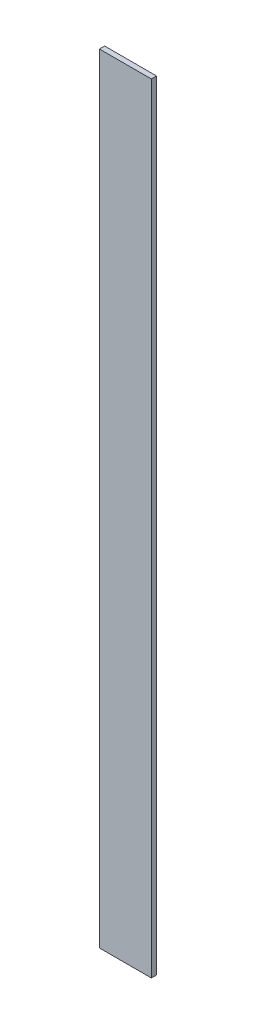
ISO-10303-21;
HEADER;
FILE_DESCRIPTION(('STEP AP214'),'2;1');
FILE_NAME('part.step','',(''),(''),'','','');
FILE_SCHEMA(('AUTOMOTIVE_DESIGN { 1 0 10303 214 1 1 1 1 }'));
ENDSEC;
DATA;
#1=APPLICATION_CONTEXT('core data for automotive mechanical design processes');
#2=APPLICATION_PROTOCOL_DEFINITION('international standard','automotive_design',2000,#1);
#3=PRODUCT_CONTEXT('',#1,'mechanical');
#4=PRODUCT('Part','Part','',(#3));
#5=PRODUCT_RELATED_PRODUCT_CATEGORY('part','',(#4));
#6=PRODUCT_DEFINITION_FORMATION('','',#4);
#7=PRODUCT_DEFINITION_CONTEXT('part definition',#1,'design');
#8=PRODUCT_DEFINITION('design','',#6,#7);
#9=PRODUCT_DEFINITION_SHAPE('','',#8);
#10=(LENGTH_UNIT() NAMED_UNIT(*) SI_UNIT(.MILLI.,.METRE.));
#11=(NAMED_UNIT(*) PLANE_ANGLE_UNIT() SI_UNIT($,.RADIAN.));
#12=(NAMED_UNIT(*) SI_UNIT($,.STERADIAN.) SOLID_ANGLE_UNIT());
#13=UNCERTAINTY_MEASURE_WITH_UNIT(LENGTH_MEASURE(1.E-05),#10,'distance_accuracy_value','');
#14=(GEOMETRIC_REPRESENTATION_CONTEXT(3) GLOBAL_UNCERTAINTY_ASSIGNED_CONTEXT((#13)) GLOBAL_UNIT_ASSIGNED_CONTEXT((#10,
#11,#12)) REPRESENTATION_CONTEXT('',''));
#15=CARTESIAN_POINT('',(0.,0.,0.));
#16=DIRECTION('',(0.,0.,1.));
#17=DIRECTION('',(1.,0.,0.));
#18=AXIS2_PLACEMENT_3D('',#15,#16,#17);
#19=CARTESIAN_POINT('',(-1156.48368854433,3000.,-804.687242443019));
#20=DIRECTION('',(1.,0.,0.));
#21=DIRECTION('',(0.,0.,-1.));
#22=AXIS2_PLACEMENT_3D('',#19,#20,#21);
#23=PLANE('',#22);
#24=DIRECTION('',(0.,0.,1.));
#25=VECTOR('',#24,1.);
#26=CARTESIAN_POINT('',(-1156.48368854433,0.,-804.687242443019));
#27=LINE('',#26,#25);
#28=CARTESIAN_POINT('',(-1156.48368854433,0.,-804.687242443019));
#29=VERTEX_POINT('',#28);
#30=CARTESIAN_POINT('',(-1156.48368854433,0.,-784.687242443019));
#31=VERTEX_POINT('',#30);
#32=EDGE_CURVE('E107',#29,#31,#27,.T.);
#33=ORIENTED_EDGE('',*,*,#32,.T.);
#34=DIRECTION('',(0.,-1.,0.));
#35=VECTOR('',#34,1.);
#36=CARTESIAN_POINT('',(-1156.48368854433,3000.,-784.687242443019));
#37=LINE('',#36,#35);
#38=CARTESIAN_POINT('',(-1156.48368854433,3000.,-784.687242443019));
#39=VERTEX_POINT('',#38);
#40=EDGE_CURVE('E11',#39,#31,#37,.T.);
#41=ORIENTED_EDGE('',*,*,#40,.F.);
#42=DIRECTION('',(0.,0.,1.));
#43=VECTOR('',#42,1.);
#44=CARTESIAN_POINT('',(-1156.48368854433,3000.,-804.687242443019));
#45=LINE('',#44,#43);
#46=CARTESIAN_POINT('',(-1156.48368854433,3000.,-804.687242443019));
#47=VERTEX_POINT('',#46);
#48=EDGE_CURVE('E89',#47,#39,#45,.T.);
#49=ORIENTED_EDGE('',*,*,#48,.F.);
#50=DIRECTION('',(0.,-1.,0.));
#51=VECTOR('',#50,1.);
#52=CARTESIAN_POINT('',(-1156.48368854433,3000.,-804.687242443019));
#53=LINE('',#52,#51);
#54=EDGE_CURVE('E56',#47,#29,#53,.T.);
#55=ORIENTED_EDGE('',*,*,#54,.T.);
#56=EDGE_LOOP('',(#33,#41,#49,#55));
#57=FACE_BOUND('',#56,.T.);
#58=ADVANCED_FACE('F39',(#57),#23,.F.);
#59=CARTESIAN_POINT('',(-1156.48368854433,3000.,-784.687242443019));
#60=DIRECTION('',(0.,0.,-1.));
#61=DIRECTION('',(-1.,0.,0.));
#62=AXIS2_PLACEMENT_3D('',#59,#60,#61);
#63=PLANE('',#62);
#64=DIRECTION('',(1.,0.,0.));
#65=VECTOR('',#64,1.);
#66=CARTESIAN_POINT('',(-1156.48368854433,0.,-784.687242443019));
#67=LINE('',#66,#65);
#68=CARTESIAN_POINT('',(-956.483688544326,0.,-784.687242443019));
#69=VERTEX_POINT('',#68);
#70=EDGE_CURVE('E95',#31,#69,#67,.T.);
#71=ORIENTED_EDGE('',*,*,#70,.T.);
#72=DIRECTION('',(0.,-1.,0.));
#73=VECTOR('',#72,1.);
#74=CARTESIAN_POINT('',(-956.483688544326,3000.,-784.687242443019));
#75=LINE('',#74,#73);
#76=CARTESIAN_POINT('',(-956.483688544326,3000.,-784.687242443019));
#77=VERTEX_POINT('',#76);
#78=EDGE_CURVE('E48',#77,#69,#75,.T.);
#79=ORIENTED_EDGE('',*,*,#78,.F.);
#80=DIRECTION('',(1.,0.,0.));
#81=VECTOR('',#80,1.);
#82=CARTESIAN_POINT('',(-1156.48368854433,3000.,-784.687242443019));
#83=LINE('',#82,#81);
#84=EDGE_CURVE('E81',#39,#77,#83,.T.);
#85=ORIENTED_EDGE('',*,*,#84,.F.);
#86=ORIENTED_EDGE('',*,*,#40,.T.);
#87=EDGE_LOOP('',(#71,#79,#85,#86));
#88=FACE_BOUND('',#87,.T.);
#89=ADVANCED_FACE('F94',(#88),#63,.F.);
#90=CARTESIAN_POINT('',(-956.483688544326,3000.,-804.687242443019));
#91=DIRECTION('',(1.,0.,0.));
#92=DIRECTION('',(0.,0.,-1.));
#93=AXIS2_PLACEMENT_3D('',#90,#91,#92);
#94=PLANE('',#93);
#95=DIRECTION('',(0.,0.,1.));
#96=VECTOR('',#95,1.);
#97=CARTESIAN_POINT('',(-956.483688544326,0.,-804.687242443019));
#98=LINE('',#97,#96);
#99=CARTESIAN_POINT('',(-956.483688544326,0.,-804.687242443019));
#100=VERTEX_POINT('',#99);
#101=EDGE_CURVE('E112',#100,#69,#98,.T.);
#102=ORIENTED_EDGE('',*,*,#101,.F.);
#103=DIRECTION('',(0.,-1.,0.));
#104=VECTOR('',#103,1.);
#105=CARTESIAN_POINT('',(-956.483688544326,3000.,-804.687242443019));
#106=LINE('',#105,#104);
#107=CARTESIAN_POINT('',(-956.483688544326,3000.,-804.687242443019));
#108=VERTEX_POINT('',#107);
#109=EDGE_CURVE('E70',#108,#100,#106,.T.);
#110=ORIENTED_EDGE('',*,*,#109,.F.);
#111=DIRECTION('',(0.,0.,1.));
#112=VECTOR('',#111,1.);
#113=CARTESIAN_POINT('',(-956.483688544326,3000.,-804.687242443019));
#114=LINE('',#113,#112);
#115=EDGE_CURVE('E88',#108,#77,#114,.T.);
#116=ORIENTED_EDGE('',*,*,#115,.T.);
#117=ORIENTED_EDGE('',*,*,#78,.T.);
#118=EDGE_LOOP('',(#102,#110,#116,#117));
#119=FACE_BOUND('',#118,.T.);
#120=ADVANCED_FACE('F99',(#119),#94,.T.);
#121=CARTESIAN_POINT('',(-1156.48368854433,3000.,-804.687242443019));
#122=DIRECTION('',(0.,0.,-1.));
#123=DIRECTION('',(-1.,0.,0.));
#124=AXIS2_PLACEMENT_3D('',#121,#122,#123);
#125=PLANE('',#124);
#126=DIRECTION('',(1.,0.,0.));
#127=VECTOR('',#126,1.);
#128=CARTESIAN_POINT('',(-1156.48368854433,0.,-804.687242443019));
#129=LINE('',#128,#127);
#130=EDGE_CURVE('E115',#29,#100,#129,.T.);
#131=ORIENTED_EDGE('',*,*,#130,.F.);
#132=ORIENTED_EDGE('',*,*,#54,.F.);
#133=DIRECTION('',(1.,0.,0.));
#134=VECTOR('',#133,1.);
#135=CARTESIAN_POINT('',(-1156.48368854433,3000.,-804.687242443019));
#136=LINE('',#135,#134);
#137=EDGE_CURVE('E101',#47,#108,#136,.T.);
#138=ORIENTED_EDGE('',*,*,#137,.T.);
#139=ORIENTED_EDGE('',*,*,#109,.T.);
#140=EDGE_LOOP('',(#131,#132,#138,#139));
#141=FACE_BOUND('',#140,.T.);
#142=ADVANCED_FACE('F125',(#141),#125,.T.);
#143=CARTESIAN_POINT('',(0.,3000.,0.));
#144=DIRECTION('',(0.,1.,0.));
#145=DIRECTION('',(0.,0.,1.));
#146=AXIS2_PLACEMENT_3D('',#143,#144,#145);
#147=PLANE('',#146);
#148=ORIENTED_EDGE('',*,*,#48,.T.);
#149=ORIENTED_EDGE('',*,*,#84,.T.);
#150=ORIENTED_EDGE('',*,*,#115,.F.);
#151=ORIENTED_EDGE('',*,*,#137,.F.);
#152=EDGE_LOOP('',(#148,#149,#150,#151));
#153=FACE_BOUND('',#152,.T.);
#154=ADVANCED_FACE('F85',(#153),#147,.T.);
#155=CARTESIAN_POINT('',(0.,0.,0.));
#156=DIRECTION('',(0.,1.,0.));
#157=DIRECTION('',(0.,0.,1.));
#158=AXIS2_PLACEMENT_3D('',#155,#156,#157);
#159=PLANE('',#158);
#160=ORIENTED_EDGE('',*,*,#32,.F.);
#161=ORIENTED_EDGE('',*,*,#130,.T.);
#162=ORIENTED_EDGE('',*,*,#101,.T.);
#163=ORIENTED_EDGE('',*,*,#70,.F.);
#164=EDGE_LOOP('',(#160,#161,#162,#163));
#165=FACE_BOUND('',#164,.T.);
#166=ADVANCED_FACE('F124',(#165),#159,.F.);
#167=CLOSED_SHELL('',(#58,#89,#120,#142,#154,#166));
#168=MANIFOLD_SOLID_BREP('B2',#167);
#169=ADVANCED_BREP_SHAPE_REPRESENTATION('',(#18,#168),#14);
#170=SHAPE_DEFINITION_REPRESENTATION(#9,#169);
ENDSEC;
END-ISO-10303-21;
